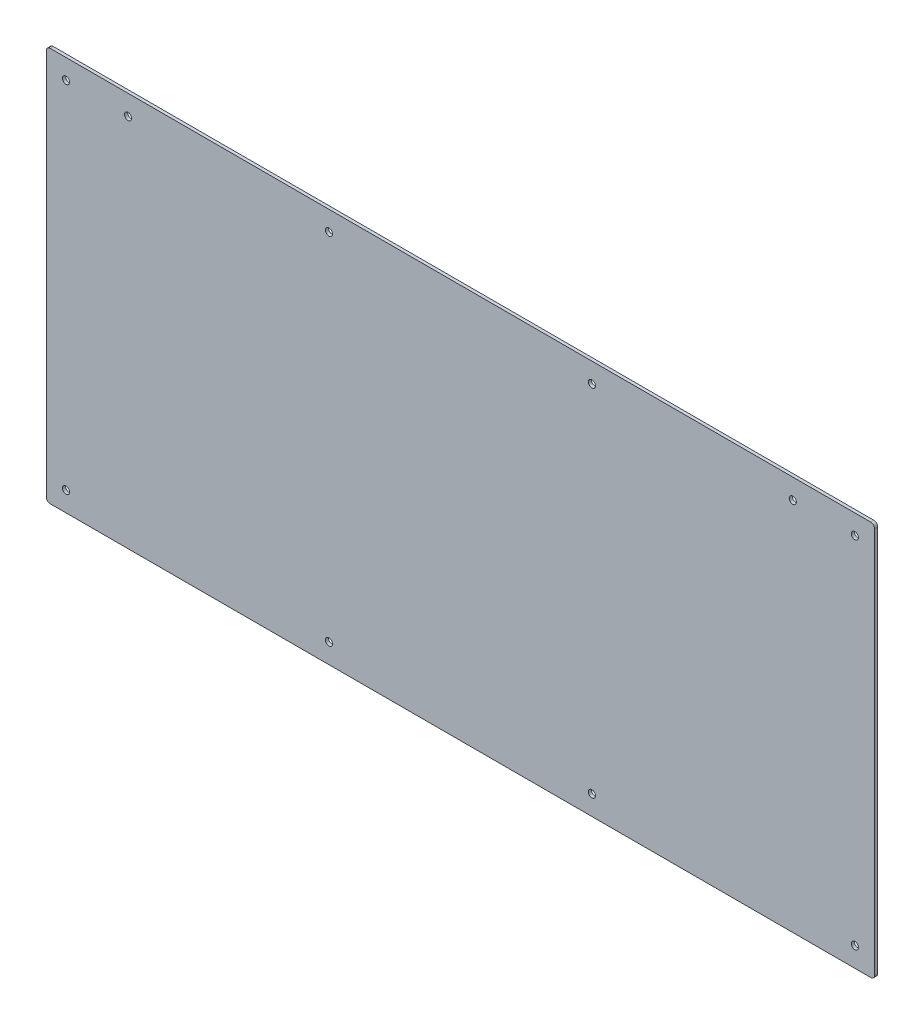
ISO-10303-21;
HEADER;
FILE_DESCRIPTION(('STEP AP214'),'2;1');
FILE_NAME('part.step','',(''),(''),'','','');
FILE_SCHEMA(('AUTOMOTIVE_DESIGN { 1 0 10303 214 1 1 1 1 }'));
ENDSEC;
DATA;
#1=APPLICATION_CONTEXT('core data for automotive mechanical design processes');
#2=APPLICATION_PROTOCOL_DEFINITION('international standard','automotive_design',2000,#1);
#3=PRODUCT_CONTEXT('',#1,'mechanical');
#4=PRODUCT('Part','Part','',(#3));
#5=PRODUCT_RELATED_PRODUCT_CATEGORY('part','',(#4));
#6=PRODUCT_DEFINITION_FORMATION('','',#4);
#7=PRODUCT_DEFINITION_CONTEXT('part definition',#1,'design');
#8=PRODUCT_DEFINITION('design','',#6,#7);
#9=PRODUCT_DEFINITION_SHAPE('','',#8);
#10=(LENGTH_UNIT() NAMED_UNIT(*) SI_UNIT(.MILLI.,.METRE.));
#11=(NAMED_UNIT(*) PLANE_ANGLE_UNIT() SI_UNIT($,.RADIAN.));
#12=(NAMED_UNIT(*) SI_UNIT($,.STERADIAN.) SOLID_ANGLE_UNIT());
#13=UNCERTAINTY_MEASURE_WITH_UNIT(LENGTH_MEASURE(1.E-05),#10,'distance_accuracy_value','');
#14=(GEOMETRIC_REPRESENTATION_CONTEXT(3) GLOBAL_UNCERTAINTY_ASSIGNED_CONTEXT((#13)) GLOBAL_UNIT_ASSIGNED_CONTEXT((#10,
#11,#12)) REPRESENTATION_CONTEXT('',''));
#15=CARTESIAN_POINT('',(0.,0.,0.));
#16=DIRECTION('',(0.,0.,1.));
#17=DIRECTION('',(1.,0.,0.));
#18=AXIS2_PLACEMENT_3D('',#15,#16,#17);
#19=CARTESIAN_POINT('',(200.,90.0000000000001,0.));
#20=DIRECTION('',(0.,0.,1.));
#21=DIRECTION('',(1.,0.,0.));
#22=AXIS2_PLACEMENT_3D('',#19,#20,#21);
#23=CYLINDRICAL_SURFACE('',#22,1.8);
#24=CARTESIAN_POINT('',(200.,90.0000000000001,-1.588));
#25=DIRECTION('',(0.,0.,1.));
#26=DIRECTION('',(1.,0.,0.));
#27=AXIS2_PLACEMENT_3D('',#24,#25,#26);
#28=CIRCLE('',#27,1.8);
#29=CARTESIAN_POINT('',(201.8,90.0000000000001,-1.588));
#30=VERTEX_POINT('',#29);
#31=EDGE_CURVE('E45',#30,#30,#28,.T.);
#32=ORIENTED_EDGE('',*,*,#31,.F.);
#33=EDGE_LOOP('',(#32));
#34=FACE_BOUND('',#33,.T.);
#35=CARTESIAN_POINT('',(200.,90.0000000000001,0.));
#36=DIRECTION('',(0.,0.,1.));
#37=DIRECTION('',(1.,0.,0.));
#38=AXIS2_PLACEMENT_3D('',#35,#36,#37);
#39=CIRCLE('',#38,1.8);
#40=CARTESIAN_POINT('',(201.8,90.0000000000001,0.));
#41=VERTEX_POINT('',#40);
#42=EDGE_CURVE('E11',#41,#41,#39,.T.);
#43=ORIENTED_EDGE('',*,*,#42,.T.);
#44=EDGE_LOOP('',(#43));
#45=FACE_BOUND('',#44,.T.);
#46=ADVANCED_FACE('F38',(#34,#45),#23,.F.);
#47=CARTESIAN_POINT('',(66.6666666666667,90.,0.));
#48=DIRECTION('',(0.,0.,1.));
#49=DIRECTION('',(1.,0.,0.));
#50=AXIS2_PLACEMENT_3D('',#47,#48,#49);
#51=CYLINDRICAL_SURFACE('',#50,1.8);
#52=CARTESIAN_POINT('',(66.6666666666667,90.,-1.588));
#53=DIRECTION('',(0.,0.,1.));
#54=DIRECTION('',(1.,0.,0.));
#55=AXIS2_PLACEMENT_3D('',#52,#53,#54);
#56=CIRCLE('',#55,1.8);
#57=CARTESIAN_POINT('',(68.4666666666667,90.,-1.588));
#58=VERTEX_POINT('',#57);
#59=EDGE_CURVE('E164',#58,#58,#56,.T.);
#60=ORIENTED_EDGE('',*,*,#59,.F.);
#61=EDGE_LOOP('',(#60));
#62=FACE_BOUND('',#61,.T.);
#63=CARTESIAN_POINT('',(66.6666666666667,90.,0.));
#64=DIRECTION('',(0.,0.,1.));
#65=DIRECTION('',(1.,0.,0.));
#66=AXIS2_PLACEMENT_3D('',#63,#64,#65);
#67=CIRCLE('',#66,1.8);
#68=CARTESIAN_POINT('',(68.4666666666667,90.,0.));
#69=VERTEX_POINT('',#68);
#70=EDGE_CURVE('E167',#69,#69,#67,.T.);
#71=ORIENTED_EDGE('',*,*,#70,.T.);
#72=EDGE_LOOP('',(#71));
#73=FACE_BOUND('',#72,.T.);
#74=ADVANCED_FACE('F176',(#62,#73),#51,.F.);
#75=CARTESIAN_POINT('',(-210.,-100.,-1.588));
#76=DIRECTION('',(-1.,0.,0.));
#77=DIRECTION('',(0.,0.,1.));
#78=AXIS2_PLACEMENT_3D('',#75,#76,#77);
#79=PLANE('',#78);
#80=DIRECTION('',(0.,-1.,0.));
#81=VECTOR('',#80,1.);
#82=CARTESIAN_POINT('',(-210.,-100.,-1.588));
#83=LINE('',#82,#81);
#84=CARTESIAN_POINT('',(-210.,97.9999999999999,-1.588));
#85=VERTEX_POINT('',#84);
#86=CARTESIAN_POINT('',(-210.,-98.0000000000001,-1.588));
#87=VERTEX_POINT('',#86);
#88=EDGE_CURVE('E407',#85,#87,#83,.T.);
#89=ORIENTED_EDGE('',*,*,#88,.T.);
#90=DIRECTION('',(0.,0.,1.));
#91=VECTOR('',#90,1.);
#92=CARTESIAN_POINT('',(-210.,-98.0000000000001,-1.588));
#93=LINE('',#92,#91);
#94=CARTESIAN_POINT('',(-210.,-98.0000000000001,0.));
#95=VERTEX_POINT('',#94);
#96=EDGE_CURVE('E116',#87,#95,#93,.T.);
#97=ORIENTED_EDGE('',*,*,#96,.T.);
#98=DIRECTION('',(0.,-1.,0.));
#99=VECTOR('',#98,1.);
#100=CARTESIAN_POINT('',(-210.,-100.,0.));
#101=LINE('',#100,#99);
#102=CARTESIAN_POINT('',(-210.,97.9999999999999,0.));
#103=VERTEX_POINT('',#102);
#104=EDGE_CURVE('E108',#103,#95,#101,.T.);
#105=ORIENTED_EDGE('',*,*,#104,.F.);
#106=DIRECTION('',(0.,0.,1.));
#107=VECTOR('',#106,1.);
#108=CARTESIAN_POINT('',(-210.,97.9999999999999,-1.588));
#109=LINE('',#108,#107);
#110=EDGE_CURVE('E122',#103,#85,#109,.F.);
#111=ORIENTED_EDGE('',*,*,#110,.T.);
#112=EDGE_LOOP('',(#89,#97,#105,#111));
#113=FACE_BOUND('',#112,.T.);
#114=ADVANCED_FACE('F121',(#113),#79,.T.);
#115=CARTESIAN_POINT('',(210.,100.,-1.588));
#116=DIRECTION('',(0.,1.,0.));
#117=DIRECTION('',(-1.,0.,0.));
#118=AXIS2_PLACEMENT_3D('',#115,#116,#117);
#119=PLANE('',#118);
#120=DIRECTION('',(-1.,0.,0.));
#121=VECTOR('',#120,1.);
#122=CARTESIAN_POINT('',(210.,100.,0.));
#123=LINE('',#122,#121);
#124=CARTESIAN_POINT('',(208.,100.,0.));
#125=VERTEX_POINT('',#124);
#126=CARTESIAN_POINT('',(-208.,99.9999999999999,0.));
#127=VERTEX_POINT('',#126);
#128=EDGE_CURVE('E110',#125,#127,#123,.T.);
#129=ORIENTED_EDGE('',*,*,#128,.F.);
#130=DIRECTION('',(0.,0.,1.));
#131=VECTOR('',#130,1.);
#132=CARTESIAN_POINT('',(208.,100.,-1.588));
#133=LINE('',#132,#131);
#134=CARTESIAN_POINT('',(208.,100.,-1.588));
#135=VERTEX_POINT('',#134);
#136=EDGE_CURVE('E162',#125,#135,#133,.F.);
#137=ORIENTED_EDGE('',*,*,#136,.T.);
#138=DIRECTION('',(-1.,0.,0.));
#139=VECTOR('',#138,1.);
#140=CARTESIAN_POINT('',(210.,100.,-1.588));
#141=LINE('',#140,#139);
#142=CARTESIAN_POINT('',(-208.,99.9999999999999,-1.588));
#143=VERTEX_POINT('',#142);
#144=EDGE_CURVE('E131',#135,#143,#141,.T.);
#145=ORIENTED_EDGE('',*,*,#144,.T.);
#146=DIRECTION('',(0.,0.,1.));
#147=VECTOR('',#146,1.);
#148=CARTESIAN_POINT('',(-208.,99.9999999999999,-1.588));
#149=LINE('',#148,#147);
#150=EDGE_CURVE('E160',#143,#127,#149,.T.);
#151=ORIENTED_EDGE('',*,*,#150,.T.);
#152=EDGE_LOOP('',(#129,#137,#145,#151));
#153=FACE_BOUND('',#152,.T.);
#154=ADVANCED_FACE('F197',(#153),#119,.T.);
#155=CARTESIAN_POINT('',(210.,-100.,-1.588));
#156=DIRECTION('',(1.,0.,0.));
#157=DIRECTION('',(0.,0.,-1.));
#158=AXIS2_PLACEMENT_3D('',#155,#156,#157);
#159=PLANE('',#158);
#160=DIRECTION('',(0.,1.,0.));
#161=VECTOR('',#160,1.);
#162=CARTESIAN_POINT('',(210.,-100.,0.));
#163=LINE('',#162,#161);
#164=CARTESIAN_POINT('',(210.,-98.,0.));
#165=VERTEX_POINT('',#164);
#166=CARTESIAN_POINT('',(210.,98.,0.));
#167=VERTEX_POINT('',#166);
#168=EDGE_CURVE('E414',#165,#167,#163,.T.);
#169=ORIENTED_EDGE('',*,*,#168,.F.);
#170=DIRECTION('',(0.,0.,1.));
#171=VECTOR('',#170,1.);
#172=CARTESIAN_POINT('',(210.,-98.,-1.588));
#173=LINE('',#172,#171);
#174=CARTESIAN_POINT('',(210.,-98.,-1.588));
#175=VERTEX_POINT('',#174);
#176=EDGE_CURVE('E59',#165,#175,#173,.F.);
#177=ORIENTED_EDGE('',*,*,#176,.T.);
#178=DIRECTION('',(0.,1.,0.));
#179=VECTOR('',#178,1.);
#180=CARTESIAN_POINT('',(210.,-100.,-1.588));
#181=LINE('',#180,#179);
#182=CARTESIAN_POINT('',(210.,98.,-1.588));
#183=VERTEX_POINT('',#182);
#184=EDGE_CURVE('E135',#175,#183,#181,.T.);
#185=ORIENTED_EDGE('',*,*,#184,.T.);
#186=DIRECTION('',(0.,0.,1.));
#187=VECTOR('',#186,1.);
#188=CARTESIAN_POINT('',(210.,98.,-1.588));
#189=LINE('',#188,#187);
#190=EDGE_CURVE('E156',#183,#167,#189,.T.);
#191=ORIENTED_EDGE('',*,*,#190,.T.);
#192=EDGE_LOOP('',(#169,#177,#185,#191));
#193=FACE_BOUND('',#192,.T.);
#194=ADVANCED_FACE('F200',(#193),#159,.T.);
#195=CARTESIAN_POINT('',(210.,-100.,-1.588));
#196=DIRECTION('',(0.,-1.,0.));
#197=DIRECTION('',(1.,0.,0.));
#198=AXIS2_PLACEMENT_3D('',#195,#196,#197);
#199=PLANE('',#198);
#200=DIRECTION('',(1.,0.,0.));
#201=VECTOR('',#200,1.);
#202=CARTESIAN_POINT('',(210.,-100.,0.));
#203=LINE('',#202,#201);
#204=CARTESIAN_POINT('',(-208.,-100.,0.));
#205=VERTEX_POINT('',#204);
#206=CARTESIAN_POINT('',(208.,-100.,0.));
#207=VERTEX_POINT('',#206);
#208=EDGE_CURVE('E125',#205,#207,#203,.T.);
#209=ORIENTED_EDGE('',*,*,#208,.F.);
#210=DIRECTION('',(0.,0.,1.));
#211=VECTOR('',#210,1.);
#212=CARTESIAN_POINT('',(-208.,-100.,-1.588));
#213=LINE('',#212,#211);
#214=CARTESIAN_POINT('',(-208.,-100.,-1.588));
#215=VERTEX_POINT('',#214);
#216=EDGE_CURVE('E148',#205,#215,#213,.F.);
#217=ORIENTED_EDGE('',*,*,#216,.T.);
#218=DIRECTION('',(1.,0.,0.));
#219=VECTOR('',#218,1.);
#220=CARTESIAN_POINT('',(210.,-100.,-1.588));
#221=LINE('',#220,#219);
#222=CARTESIAN_POINT('',(208.,-100.,-1.588));
#223=VERTEX_POINT('',#222);
#224=EDGE_CURVE('E409',#215,#223,#221,.T.);
#225=ORIENTED_EDGE('',*,*,#224,.T.);
#226=DIRECTION('',(0.,0.,1.));
#227=VECTOR('',#226,1.);
#228=CARTESIAN_POINT('',(208.,-100.,-1.588));
#229=LINE('',#228,#227);
#230=EDGE_CURVE('E145',#223,#207,#229,.T.);
#231=ORIENTED_EDGE('',*,*,#230,.T.);
#232=EDGE_LOOP('',(#209,#217,#225,#231));
#233=FACE_BOUND('',#232,.T.);
#234=ADVANCED_FACE('F190',(#233),#199,.T.);
#235=CARTESIAN_POINT('',(0.,0.,-1.588));
#236=DIRECTION('',(0.,0.,1.));
#237=DIRECTION('',(1.,0.,0.));
#238=AXIS2_PLACEMENT_3D('',#235,#236,#237);
#239=PLANE('',#238);
#240=CARTESIAN_POINT('',(168.522812917981,89.8453547691247,-1.588));
#241=DIRECTION('',(0.,0.,1.));
#242=DIRECTION('',(1.,0.,0.));
#243=AXIS2_PLACEMENT_3D('',#240,#241,#242);
#244=CIRCLE('',#243,1.8);
#245=CARTESIAN_POINT('',(170.322812917981,89.8453547691247,-1.588));
#246=VERTEX_POINT('',#245);
#247=EDGE_CURVE('E456',#246,#246,#244,.T.);
#248=ORIENTED_EDGE('',*,*,#247,.T.);
#249=EDGE_LOOP('',(#248));
#250=FACE_BOUND('',#249,.T.);
#251=CARTESIAN_POINT('',(-168.522812917981,89.8453547691247,-1.588));
#252=DIRECTION('',(0.,0.,1.));
#253=DIRECTION('',(1.,0.,0.));
#254=AXIS2_PLACEMENT_3D('',#251,#252,#253);
#255=CIRCLE('',#254,1.8);
#256=CARTESIAN_POINT('',(-166.722812917981,89.8453547691247,-1.588));
#257=VERTEX_POINT('',#256);
#258=EDGE_CURVE('E450',#257,#257,#255,.T.);
#259=ORIENTED_EDGE('',*,*,#258,.T.);
#260=EDGE_LOOP('',(#259));
#261=FACE_BOUND('',#260,.T.);
#262=CARTESIAN_POINT('',(200.,-90.0000000000001,-1.588));
#263=DIRECTION('',(0.,0.,1.));
#264=DIRECTION('',(1.,0.,0.));
#265=AXIS2_PLACEMENT_3D('',#262,#263,#264);
#266=CIRCLE('',#265,1.8);
#267=CARTESIAN_POINT('',(201.8,-90.0000000000001,-1.588));
#268=VERTEX_POINT('',#267);
#269=EDGE_CURVE('E444',#268,#268,#266,.T.);
#270=ORIENTED_EDGE('',*,*,#269,.T.);
#271=EDGE_LOOP('',(#270));
#272=FACE_BOUND('',#271,.T.);
#273=CARTESIAN_POINT('',(66.6666666666667,-90.0000000000001,-1.588));
#274=DIRECTION('',(0.,0.,1.));
#275=DIRECTION('',(1.,0.,0.));
#276=AXIS2_PLACEMENT_3D('',#273,#274,#275);
#277=CIRCLE('',#276,1.8);
#278=CARTESIAN_POINT('',(68.4666666666667,-90.0000000000001,-1.588));
#279=VERTEX_POINT('',#278);
#280=EDGE_CURVE('E438',#279,#279,#277,.T.);
#281=ORIENTED_EDGE('',*,*,#280,.T.);
#282=EDGE_LOOP('',(#281));
#283=FACE_BOUND('',#282,.T.);
#284=CARTESIAN_POINT('',(-66.6666666666666,-90.,-1.588));
#285=DIRECTION('',(0.,0.,1.));
#286=DIRECTION('',(1.,0.,0.));
#287=AXIS2_PLACEMENT_3D('',#284,#285,#286);
#288=CIRCLE('',#287,1.8);
#289=CARTESIAN_POINT('',(-64.8666666666666,-90.,-1.588));
#290=VERTEX_POINT('',#289);
#291=EDGE_CURVE('E432',#290,#290,#288,.T.);
#292=ORIENTED_EDGE('',*,*,#291,.T.);
#293=EDGE_LOOP('',(#292));
#294=FACE_BOUND('',#293,.T.);
#295=CARTESIAN_POINT('',(-200.,-90.,-1.588));
#296=DIRECTION('',(0.,0.,1.));
#297=DIRECTION('',(1.,0.,0.));
#298=AXIS2_PLACEMENT_3D('',#295,#296,#297);
#299=CIRCLE('',#298,1.8);
#300=CARTESIAN_POINT('',(-198.2,-90.,-1.588));
#301=VERTEX_POINT('',#300);
#302=EDGE_CURVE('E426',#301,#301,#299,.T.);
#303=ORIENTED_EDGE('',*,*,#302,.T.);
#304=EDGE_LOOP('',(#303));
#305=FACE_BOUND('',#304,.T.);
#306=CARTESIAN_POINT('',(-66.6666666666666,90.,-1.588));
#307=DIRECTION('',(0.,0.,1.));
#308=DIRECTION('',(1.,0.,0.));
#309=AXIS2_PLACEMENT_3D('',#306,#307,#308);
#310=CIRCLE('',#309,1.8);
#311=CARTESIAN_POINT('',(-64.8666666666666,90.,-1.588));
#312=VERTEX_POINT('',#311);
#313=EDGE_CURVE('E403',#312,#312,#310,.T.);
#314=ORIENTED_EDGE('',*,*,#313,.T.);
#315=EDGE_LOOP('',(#314));
#316=FACE_BOUND('',#315,.T.);
#317=CARTESIAN_POINT('',(-200.,90.,-1.588));
#318=DIRECTION('',(0.,0.,1.));
#319=DIRECTION('',(1.,0.,0.));
#320=AXIS2_PLACEMENT_3D('',#317,#318,#319);
#321=CIRCLE('',#320,1.8);
#322=CARTESIAN_POINT('',(-198.2,90.,-1.588));
#323=VERTEX_POINT('',#322);
#324=EDGE_CURVE('E126',#323,#323,#321,.T.);
#325=ORIENTED_EDGE('',*,*,#324,.T.);
#326=EDGE_LOOP('',(#325));
#327=FACE_BOUND('',#326,.T.);
#328=ORIENTED_EDGE('',*,*,#224,.F.);
#329=CARTESIAN_POINT('',(-208.,-98.0000000000001,-1.588));
#330=DIRECTION('',(0.,0.,1.));
#331=DIRECTION('',(1.,0.,0.));
#332=AXIS2_PLACEMENT_3D('',#329,#330,#331);
#333=CIRCLE('',#332,2.);
#334=EDGE_CURVE('E154',#215,#87,#333,.F.);
#335=ORIENTED_EDGE('',*,*,#334,.T.);
#336=ORIENTED_EDGE('',*,*,#88,.F.);
#337=CARTESIAN_POINT('',(-208.,97.9999999999999,-1.588));
#338=DIRECTION('',(0.,0.,1.));
#339=DIRECTION('',(1.,0.,0.));
#340=AXIS2_PLACEMENT_3D('',#337,#338,#339);
#341=CIRCLE('',#340,2.);
#342=EDGE_CURVE('E130',#85,#143,#341,.F.);
#343=ORIENTED_EDGE('',*,*,#342,.T.);
#344=ORIENTED_EDGE('',*,*,#144,.F.);
#345=CARTESIAN_POINT('',(208.,98.,-1.588));
#346=DIRECTION('',(0.,0.,1.));
#347=DIRECTION('',(1.,0.,0.));
#348=AXIS2_PLACEMENT_3D('',#345,#346,#347);
#349=CIRCLE('',#348,2.);
#350=EDGE_CURVE('E52',#135,#183,#349,.F.);
#351=ORIENTED_EDGE('',*,*,#350,.T.);
#352=ORIENTED_EDGE('',*,*,#184,.F.);
#353=CARTESIAN_POINT('',(208.,-98.,-1.588));
#354=DIRECTION('',(0.,0.,1.));
#355=DIRECTION('',(1.,0.,0.));
#356=AXIS2_PLACEMENT_3D('',#353,#354,#355);
#357=CIRCLE('',#356,2.);
#358=EDGE_CURVE('E152',#175,#223,#357,.F.);
#359=ORIENTED_EDGE('',*,*,#358,.T.);
#360=EDGE_LOOP('',(#328,#335,#336,#343,#344,#351,#352,#359));
#361=FACE_BOUND('',#360,.T.);
#362=ORIENTED_EDGE('',*,*,#59,.T.);
#363=EDGE_LOOP('',(#362));
#364=FACE_BOUND('',#363,.T.);
#365=ORIENTED_EDGE('',*,*,#31,.T.);
#366=EDGE_LOOP('',(#365));
#367=FACE_BOUND('',#366,.T.);
#368=ADVANCED_FACE('F172',(#250,#261,#272,#283,#294,#305,#316,#327,#361,#364,#367),#239,.F.);
#369=CARTESIAN_POINT('',(0.,0.,0.));
#370=DIRECTION('',(0.,0.,1.));
#371=DIRECTION('',(1.,0.,0.));
#372=AXIS2_PLACEMENT_3D('',#369,#370,#371);
#373=PLANE('',#372);
#374=CARTESIAN_POINT('',(168.522812917981,89.8453547691247,0.));
#375=DIRECTION('',(0.,0.,1.));
#376=DIRECTION('',(1.,0.,0.));
#377=AXIS2_PLACEMENT_3D('',#374,#375,#376);
#378=CIRCLE('',#377,1.8);
#379=CARTESIAN_POINT('',(170.322812917981,89.8453547691247,0.));
#380=VERTEX_POINT('',#379);
#381=EDGE_CURVE('E459',#380,#380,#378,.T.);
#382=ORIENTED_EDGE('',*,*,#381,.F.);
#383=EDGE_LOOP('',(#382));
#384=FACE_BOUND('',#383,.T.);
#385=CARTESIAN_POINT('',(-168.522812917981,89.8453547691247,0.));
#386=DIRECTION('',(0.,0.,1.));
#387=DIRECTION('',(1.,0.,0.));
#388=AXIS2_PLACEMENT_3D('',#385,#386,#387);
#389=CIRCLE('',#388,1.8);
#390=CARTESIAN_POINT('',(-166.722812917981,89.8453547691247,0.));
#391=VERTEX_POINT('',#390);
#392=EDGE_CURVE('E453',#391,#391,#389,.T.);
#393=ORIENTED_EDGE('',*,*,#392,.F.);
#394=EDGE_LOOP('',(#393));
#395=FACE_BOUND('',#394,.T.);
#396=CARTESIAN_POINT('',(200.,-90.0000000000001,0.));
#397=DIRECTION('',(0.,0.,1.));
#398=DIRECTION('',(1.,0.,0.));
#399=AXIS2_PLACEMENT_3D('',#396,#397,#398);
#400=CIRCLE('',#399,1.8);
#401=CARTESIAN_POINT('',(201.8,-90.0000000000001,0.));
#402=VERTEX_POINT('',#401);
#403=EDGE_CURVE('E447',#402,#402,#400,.T.);
#404=ORIENTED_EDGE('',*,*,#403,.F.);
#405=EDGE_LOOP('',(#404));
#406=FACE_BOUND('',#405,.T.);
#407=CARTESIAN_POINT('',(66.6666666666667,-90.0000000000001,0.));
#408=DIRECTION('',(0.,0.,1.));
#409=DIRECTION('',(1.,0.,0.));
#410=AXIS2_PLACEMENT_3D('',#407,#408,#409);
#411=CIRCLE('',#410,1.79999999999998);
#412=CARTESIAN_POINT('',(68.4666666666667,-90.0000000000001,0.));
#413=VERTEX_POINT('',#412);
#414=EDGE_CURVE('E441',#413,#413,#411,.T.);
#415=ORIENTED_EDGE('',*,*,#414,.F.);
#416=EDGE_LOOP('',(#415));
#417=FACE_BOUND('',#416,.T.);
#418=CARTESIAN_POINT('',(-66.6666666666666,-90.,0.));
#419=DIRECTION('',(0.,0.,1.));
#420=DIRECTION('',(1.,0.,0.));
#421=AXIS2_PLACEMENT_3D('',#418,#419,#420);
#422=CIRCLE('',#421,1.79999999999998);
#423=CARTESIAN_POINT('',(-64.8666666666666,-90.,0.));
#424=VERTEX_POINT('',#423);
#425=EDGE_CURVE('E435',#424,#424,#422,.T.);
#426=ORIENTED_EDGE('',*,*,#425,.F.);
#427=EDGE_LOOP('',(#426));
#428=FACE_BOUND('',#427,.T.);
#429=CARTESIAN_POINT('',(-200.,-90.,0.));
#430=DIRECTION('',(0.,0.,1.));
#431=DIRECTION('',(1.,0.,0.));
#432=AXIS2_PLACEMENT_3D('',#429,#430,#431);
#433=CIRCLE('',#432,1.8);
#434=CARTESIAN_POINT('',(-198.2,-90.,0.));
#435=VERTEX_POINT('',#434);
#436=EDGE_CURVE('E429',#435,#435,#433,.T.);
#437=ORIENTED_EDGE('',*,*,#436,.F.);
#438=EDGE_LOOP('',(#437));
#439=FACE_BOUND('',#438,.T.);
#440=CARTESIAN_POINT('',(-66.6666666666666,90.,0.));
#441=DIRECTION('',(0.,0.,1.));
#442=DIRECTION('',(1.,0.,0.));
#443=AXIS2_PLACEMENT_3D('',#440,#441,#442);
#444=CIRCLE('',#443,1.8);
#445=CARTESIAN_POINT('',(-64.8666666666666,90.,0.));
#446=VERTEX_POINT('',#445);
#447=EDGE_CURVE('E399',#446,#446,#444,.T.);
#448=ORIENTED_EDGE('',*,*,#447,.F.);
#449=EDGE_LOOP('',(#448));
#450=FACE_BOUND('',#449,.T.);
#451=CARTESIAN_POINT('',(-200.,90.,0.));
#452=DIRECTION('',(0.,0.,1.));
#453=DIRECTION('',(1.,0.,0.));
#454=AXIS2_PLACEMENT_3D('',#451,#452,#453);
#455=CIRCLE('',#454,1.8);
#456=CARTESIAN_POINT('',(-198.2,90.,0.));
#457=VERTEX_POINT('',#456);
#458=EDGE_CURVE('E397',#457,#457,#455,.T.);
#459=ORIENTED_EDGE('',*,*,#458,.F.);
#460=EDGE_LOOP('',(#459));
#461=FACE_BOUND('',#460,.T.);
#462=ORIENTED_EDGE('',*,*,#104,.T.);
#463=CARTESIAN_POINT('',(-208.,-98.0000000000001,0.));
#464=DIRECTION('',(0.,0.,1.));
#465=DIRECTION('',(1.,0.,0.));
#466=AXIS2_PLACEMENT_3D('',#463,#464,#465);
#467=CIRCLE('',#466,2.);
#468=EDGE_CURVE('E143',#95,#205,#467,.T.);
#469=ORIENTED_EDGE('',*,*,#468,.T.);
#470=ORIENTED_EDGE('',*,*,#208,.T.);
#471=CARTESIAN_POINT('',(208.,-98.,0.));
#472=DIRECTION('',(0.,0.,1.));
#473=DIRECTION('',(1.,0.,0.));
#474=AXIS2_PLACEMENT_3D('',#471,#472,#473);
#475=CIRCLE('',#474,2.);
#476=EDGE_CURVE('E141',#207,#165,#475,.T.);
#477=ORIENTED_EDGE('',*,*,#476,.T.);
#478=ORIENTED_EDGE('',*,*,#168,.T.);
#479=CARTESIAN_POINT('',(208.,98.,0.));
#480=DIRECTION('',(0.,0.,1.));
#481=DIRECTION('',(1.,0.,0.));
#482=AXIS2_PLACEMENT_3D('',#479,#480,#481);
#483=CIRCLE('',#482,2.);
#484=EDGE_CURVE('E115',#167,#125,#483,.T.);
#485=ORIENTED_EDGE('',*,*,#484,.T.);
#486=ORIENTED_EDGE('',*,*,#128,.T.);
#487=CARTESIAN_POINT('',(-208.,97.9999999999999,0.));
#488=DIRECTION('',(0.,0.,1.));
#489=DIRECTION('',(1.,0.,0.));
#490=AXIS2_PLACEMENT_3D('',#487,#488,#489);
#491=CIRCLE('',#490,2.);
#492=EDGE_CURVE('E104',#127,#103,#491,.T.);
#493=ORIENTED_EDGE('',*,*,#492,.T.);
#494=EDGE_LOOP('',(#462,#469,#470,#477,#478,#485,#486,#493));
#495=FACE_BOUND('',#494,.T.);
#496=ORIENTED_EDGE('',*,*,#70,.F.);
#497=EDGE_LOOP('',(#496));
#498=FACE_BOUND('',#497,.T.);
#499=ORIENTED_EDGE('',*,*,#42,.F.);
#500=EDGE_LOOP('',(#499));
#501=FACE_BOUND('',#500,.T.);
#502=ADVANCED_FACE('F106',(#384,#395,#406,#417,#428,#439,#450,#461,#495,#498,#501),#373,.T.);
#503=CARTESIAN_POINT('',(-208.,-98.0000000000001,-1.588));
#504=DIRECTION('',(0.,0.,1.));
#505=DIRECTION('',(1.,0.,0.));
#506=AXIS2_PLACEMENT_3D('',#503,#504,#505);
#507=CYLINDRICAL_SURFACE('',#506,2.);
#508=ORIENTED_EDGE('',*,*,#334,.F.);
#509=ORIENTED_EDGE('',*,*,#216,.F.);
#510=ORIENTED_EDGE('',*,*,#468,.F.);
#511=ORIENTED_EDGE('',*,*,#96,.F.);
#512=EDGE_LOOP('',(#508,#509,#510,#511));
#513=FACE_BOUND('',#512,.T.);
#514=ADVANCED_FACE('F180',(#513),#507,.T.);
#515=CARTESIAN_POINT('',(208.,-98.,-1.588));
#516=DIRECTION('',(0.,0.,1.));
#517=DIRECTION('',(1.,0.,0.));
#518=AXIS2_PLACEMENT_3D('',#515,#516,#517);
#519=CYLINDRICAL_SURFACE('',#518,2.);
#520=ORIENTED_EDGE('',*,*,#358,.F.);
#521=ORIENTED_EDGE('',*,*,#176,.F.);
#522=ORIENTED_EDGE('',*,*,#476,.F.);
#523=ORIENTED_EDGE('',*,*,#230,.F.);
#524=EDGE_LOOP('',(#520,#521,#522,#523));
#525=FACE_BOUND('',#524,.T.);
#526=ADVANCED_FACE('F187',(#525),#519,.T.);
#527=CARTESIAN_POINT('',(208.,98.,-1.588));
#528=DIRECTION('',(0.,0.,1.));
#529=DIRECTION('',(1.,0.,0.));
#530=AXIS2_PLACEMENT_3D('',#527,#528,#529);
#531=CYLINDRICAL_SURFACE('',#530,2.);
#532=ORIENTED_EDGE('',*,*,#350,.F.);
#533=ORIENTED_EDGE('',*,*,#136,.F.);
#534=ORIENTED_EDGE('',*,*,#484,.F.);
#535=ORIENTED_EDGE('',*,*,#190,.F.);
#536=EDGE_LOOP('',(#532,#533,#534,#535));
#537=FACE_BOUND('',#536,.T.);
#538=ADVANCED_FACE('F211',(#537),#531,.T.);
#539=CARTESIAN_POINT('',(-208.,97.9999999999999,-1.588));
#540=DIRECTION('',(0.,0.,1.));
#541=DIRECTION('',(1.,0.,0.));
#542=AXIS2_PLACEMENT_3D('',#539,#540,#541);
#543=CYLINDRICAL_SURFACE('',#542,2.);
#544=ORIENTED_EDGE('',*,*,#342,.F.);
#545=ORIENTED_EDGE('',*,*,#110,.F.);
#546=ORIENTED_EDGE('',*,*,#492,.F.);
#547=ORIENTED_EDGE('',*,*,#150,.F.);
#548=EDGE_LOOP('',(#544,#545,#546,#547));
#549=FACE_BOUND('',#548,.T.);
#550=ADVANCED_FACE('F129',(#549),#543,.T.);
#551=CARTESIAN_POINT('',(-200.,90.,0.));
#552=DIRECTION('',(0.,0.,1.));
#553=DIRECTION('',(1.,0.,0.));
#554=AXIS2_PLACEMENT_3D('',#551,#552,#553);
#555=CYLINDRICAL_SURFACE('',#554,1.8);
#556=ORIENTED_EDGE('',*,*,#324,.F.);
#557=EDGE_LOOP('',(#556));
#558=FACE_BOUND('',#557,.T.);
#559=ORIENTED_EDGE('',*,*,#458,.T.);
#560=EDGE_LOOP('',(#559));
#561=FACE_BOUND('',#560,.T.);
#562=ADVANCED_FACE('F217',(#558,#561),#555,.F.);
#563=CARTESIAN_POINT('',(-66.6666666666666,90.,0.));
#564=DIRECTION('',(0.,0.,1.));
#565=DIRECTION('',(1.,0.,0.));
#566=AXIS2_PLACEMENT_3D('',#563,#564,#565);
#567=CYLINDRICAL_SURFACE('',#566,1.8);
#568=ORIENTED_EDGE('',*,*,#313,.F.);
#569=EDGE_LOOP('',(#568));
#570=FACE_BOUND('',#569,.T.);
#571=ORIENTED_EDGE('',*,*,#447,.T.);
#572=EDGE_LOOP('',(#571));
#573=FACE_BOUND('',#572,.T.);
#574=ADVANCED_FACE('F308',(#570,#573),#567,.F.);
#575=CARTESIAN_POINT('',(-200.,-90.,0.));
#576=DIRECTION('',(0.,0.,1.));
#577=DIRECTION('',(1.,0.,0.));
#578=AXIS2_PLACEMENT_3D('',#575,#576,#577);
#579=CYLINDRICAL_SURFACE('',#578,1.8);
#580=ORIENTED_EDGE('',*,*,#302,.F.);
#581=EDGE_LOOP('',(#580));
#582=FACE_BOUND('',#581,.T.);
#583=ORIENTED_EDGE('',*,*,#436,.T.);
#584=EDGE_LOOP('',(#583));
#585=FACE_BOUND('',#584,.T.);
#586=ADVANCED_FACE('F300',(#582,#585),#579,.F.);
#587=CARTESIAN_POINT('',(-66.6666666666666,-90.,0.));
#588=DIRECTION('',(0.,0.,1.));
#589=DIRECTION('',(1.,0.,0.));
#590=AXIS2_PLACEMENT_3D('',#587,#588,#589);
#591=CYLINDRICAL_SURFACE('',#590,1.79999999999999);
#592=ORIENTED_EDGE('',*,*,#291,.F.);
#593=EDGE_LOOP('',(#592));
#594=FACE_BOUND('',#593,.T.);
#595=ORIENTED_EDGE('',*,*,#425,.T.);
#596=EDGE_LOOP('',(#595));
#597=FACE_BOUND('',#596,.T.);
#598=ADVANCED_FACE('F292',(#594,#597),#591,.F.);
#599=CARTESIAN_POINT('',(66.6666666666667,-90.0000000000001,0.));
#600=DIRECTION('',(0.,0.,1.));
#601=DIRECTION('',(1.,0.,0.));
#602=AXIS2_PLACEMENT_3D('',#599,#600,#601);
#603=CYLINDRICAL_SURFACE('',#602,1.79999999999999);
#604=ORIENTED_EDGE('',*,*,#280,.F.);
#605=EDGE_LOOP('',(#604));
#606=FACE_BOUND('',#605,.T.);
#607=ORIENTED_EDGE('',*,*,#414,.T.);
#608=EDGE_LOOP('',(#607));
#609=FACE_BOUND('',#608,.T.);
#610=ADVANCED_FACE('F284',(#606,#609),#603,.F.);
#611=CARTESIAN_POINT('',(200.,-90.0000000000001,0.));
#612=DIRECTION('',(0.,0.,1.));
#613=DIRECTION('',(1.,0.,0.));
#614=AXIS2_PLACEMENT_3D('',#611,#612,#613);
#615=CYLINDRICAL_SURFACE('',#614,1.8);
#616=ORIENTED_EDGE('',*,*,#269,.F.);
#617=EDGE_LOOP('',(#616));
#618=FACE_BOUND('',#617,.T.);
#619=ORIENTED_EDGE('',*,*,#403,.T.);
#620=EDGE_LOOP('',(#619));
#621=FACE_BOUND('',#620,.T.);
#622=ADVANCED_FACE('F279',(#618,#621),#615,.F.);
#623=CARTESIAN_POINT('',(-168.522812917981,89.8453547691247,0.));
#624=DIRECTION('',(0.,0.,1.));
#625=DIRECTION('',(1.,0.,0.));
#626=AXIS2_PLACEMENT_3D('',#623,#624,#625);
#627=CYLINDRICAL_SURFACE('',#626,1.8);
#628=ORIENTED_EDGE('',*,*,#258,.F.);
#629=EDGE_LOOP('',(#628));
#630=FACE_BOUND('',#629,.T.);
#631=ORIENTED_EDGE('',*,*,#392,.T.);
#632=EDGE_LOOP('',(#631));
#633=FACE_BOUND('',#632,.T.);
#634=ADVANCED_FACE('F257',(#630,#633),#627,.F.);
#635=CARTESIAN_POINT('',(168.522812917981,89.8453547691247,0.));
#636=DIRECTION('',(0.,0.,1.));
#637=DIRECTION('',(1.,0.,0.));
#638=AXIS2_PLACEMENT_3D('',#635,#636,#637);
#639=CYLINDRICAL_SURFACE('',#638,1.8);
#640=ORIENTED_EDGE('',*,*,#247,.F.);
#641=EDGE_LOOP('',(#640));
#642=FACE_BOUND('',#641,.T.);
#643=ORIENTED_EDGE('',*,*,#381,.T.);
#644=EDGE_LOOP('',(#643));
#645=FACE_BOUND('',#644,.T.);
#646=ADVANCED_FACE('F268',(#642,#645),#639,.F.);
#647=CLOSED_SHELL('',(#46,#74,#114,#154,#194,#234,#368,#502,#514,#526,#538,#550,#562,#574,#586,
#598,#610,#622,#634,#646));
#648=MANIFOLD_SOLID_BREP('B2',#647);
#649=ADVANCED_BREP_SHAPE_REPRESENTATION('',(#18,#648),#14);
#650=SHAPE_DEFINITION_REPRESENTATION(#9,#649);
ENDSEC;
END-ISO-10303-21;
